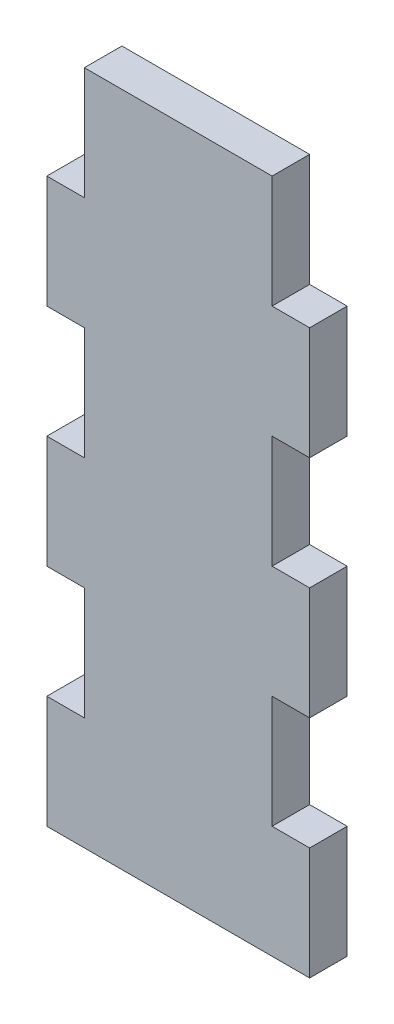
ISO-10303-21;
HEADER;
FILE_DESCRIPTION(('STEP AP214'),'2;1');
FILE_NAME('part.step','',(''),(''),'','','');
FILE_SCHEMA(('AUTOMOTIVE_DESIGN { 1 0 10303 214 1 1 1 1 }'));
ENDSEC;
DATA;
#1=APPLICATION_CONTEXT('core data for automotive mechanical design processes');
#2=APPLICATION_PROTOCOL_DEFINITION('international standard','automotive_design',2000,#1);
#3=PRODUCT_CONTEXT('',#1,'mechanical');
#4=PRODUCT('Part','Part','',(#3));
#5=PRODUCT_RELATED_PRODUCT_CATEGORY('part','',(#4));
#6=PRODUCT_DEFINITION_FORMATION('','',#4);
#7=PRODUCT_DEFINITION_CONTEXT('part definition',#1,'design');
#8=PRODUCT_DEFINITION('design','',#6,#7);
#9=PRODUCT_DEFINITION_SHAPE('','',#8);
#10=(LENGTH_UNIT() NAMED_UNIT(*) SI_UNIT(.MILLI.,.METRE.));
#11=(NAMED_UNIT(*) PLANE_ANGLE_UNIT() SI_UNIT($,.RADIAN.));
#12=(NAMED_UNIT(*) SI_UNIT($,.STERADIAN.) SOLID_ANGLE_UNIT());
#13=UNCERTAINTY_MEASURE_WITH_UNIT(LENGTH_MEASURE(1.E-05),#10,'distance_accuracy_value','');
#14=(GEOMETRIC_REPRESENTATION_CONTEXT(3) GLOBAL_UNCERTAINTY_ASSIGNED_CONTEXT((#13)) GLOBAL_UNIT_ASSIGNED_CONTEXT((#10,
#11,#12)) REPRESENTATION_CONTEXT('',''));
#15=CARTESIAN_POINT('',(0.,0.,0.));
#16=DIRECTION('',(0.,0.,1.));
#17=DIRECTION('',(1.,0.,0.));
#18=AXIS2_PLACEMENT_3D('',#15,#16,#17);
#19=CARTESIAN_POINT('',(25.4993877659802,63.7490223142231,6.));
#20=DIRECTION('',(0.,-1.,0.));
#21=DIRECTION('',(0.,0.,-1.));
#22=AXIS2_PLACEMENT_3D('',#19,#20,#21);
#23=PLANE('',#22);
#24=DIRECTION('',(-1.,0.,0.));
#25=VECTOR('',#24,1.);
#26=CARTESIAN_POINT('',(25.4993877659802,63.7490223142231,0.));
#27=LINE('',#26,#25);
#28=CARTESIAN_POINT('',(25.4993877659802,63.7490223142231,0.));
#29=VERTEX_POINT('',#28);
#30=CARTESIAN_POINT('',(19.4993877659802,63.7490223142231,0.));
#31=VERTEX_POINT('',#30);
#32=EDGE_CURVE('E235',#29,#31,#27,.T.);
#33=ORIENTED_EDGE('',*,*,#32,.T.);
#34=DIRECTION('',(0.,0.,-1.));
#35=VECTOR('',#34,1.);
#36=CARTESIAN_POINT('',(19.4993877659802,63.7490223142231,6.));
#37=LINE('',#36,#35);
#38=CARTESIAN_POINT('',(19.4993877659802,63.7490223142231,6.));
#39=VERTEX_POINT('',#38);
#40=EDGE_CURVE('E11',#39,#31,#37,.T.);
#41=ORIENTED_EDGE('',*,*,#40,.F.);
#42=DIRECTION('',(-1.,0.,0.));
#43=VECTOR('',#42,1.);
#44=CARTESIAN_POINT('',(25.4993877659802,63.7490223142231,6.));
#45=LINE('',#44,#43);
#46=CARTESIAN_POINT('',(25.4993877659802,63.7490223142231,6.));
#47=VERTEX_POINT('',#46);
#48=EDGE_CURVE('E319',#47,#39,#45,.T.);
#49=ORIENTED_EDGE('',*,*,#48,.F.);
#50=DIRECTION('',(0.,0.,-1.));
#51=VECTOR('',#50,1.);
#52=CARTESIAN_POINT('',(25.4993877659802,63.7490223142231,6.));
#53=LINE('',#52,#51);
#54=EDGE_CURVE('E231',#47,#29,#53,.T.);
#55=ORIENTED_EDGE('',*,*,#54,.T.);
#56=EDGE_LOOP('',(#33,#41,#49,#55));
#57=FACE_BOUND('',#56,.T.);
#58=ADVANCED_FACE('F39',(#57),#23,.F.);
#59=CARTESIAN_POINT('',(19.4993877659802,63.7490223142231,6.));
#60=DIRECTION('',(1.,0.,0.));
#61=DIRECTION('',(0.,0.,-1.));
#62=AXIS2_PLACEMENT_3D('',#59,#60,#61);
#63=PLANE('',#62);
#64=DIRECTION('',(0.,-1.,0.));
#65=VECTOR('',#64,1.);
#66=CARTESIAN_POINT('',(19.4993877659802,63.7490223142231,0.));
#67=LINE('',#66,#65);
#68=CARTESIAN_POINT('',(19.4993877659802,45.7490223142231,0.));
#69=VERTEX_POINT('',#68);
#70=EDGE_CURVE('E239',#31,#69,#67,.T.);
#71=ORIENTED_EDGE('',*,*,#70,.T.);
#72=DIRECTION('',(0.,0.,-1.));
#73=VECTOR('',#72,1.);
#74=CARTESIAN_POINT('',(19.4993877659802,45.7490223142231,6.));
#75=LINE('',#74,#73);
#76=CARTESIAN_POINT('',(19.4993877659802,45.7490223142231,6.));
#77=VERTEX_POINT('',#76);
#78=EDGE_CURVE('E48',#77,#69,#75,.T.);
#79=ORIENTED_EDGE('',*,*,#78,.F.);
#80=DIRECTION('',(0.,-1.,0.));
#81=VECTOR('',#80,1.);
#82=CARTESIAN_POINT('',(19.4993877659802,63.7490223142231,6.));
#83=LINE('',#82,#81);
#84=EDGE_CURVE('E143',#39,#77,#83,.T.);
#85=ORIENTED_EDGE('',*,*,#84,.F.);
#86=ORIENTED_EDGE('',*,*,#40,.T.);
#87=EDGE_LOOP('',(#71,#79,#85,#86));
#88=FACE_BOUND('',#87,.T.);
#89=ADVANCED_FACE('F495',(#88),#63,.F.);
#90=CARTESIAN_POINT('',(19.4993877659802,45.7490223142231,6.));
#91=DIRECTION('',(0.,1.,0.));
#92=DIRECTION('',(0.,0.,1.));
#93=AXIS2_PLACEMENT_3D('',#90,#91,#92);
#94=PLANE('',#93);
#95=DIRECTION('',(1.,0.,0.));
#96=VECTOR('',#95,1.);
#97=CARTESIAN_POINT('',(19.4993877659802,45.7490223142231,0.));
#98=LINE('',#97,#96);
#99=CARTESIAN_POINT('',(25.4993877659802,45.7490223142231,0.));
#100=VERTEX_POINT('',#99);
#101=EDGE_CURVE('E242',#69,#100,#98,.T.);
#102=ORIENTED_EDGE('',*,*,#101,.T.);
#103=DIRECTION('',(0.,0.,-1.));
#104=VECTOR('',#103,1.);
#105=CARTESIAN_POINT('',(25.4993877659802,45.7490223142231,6.));
#106=LINE('',#105,#104);
#107=CARTESIAN_POINT('',(25.4993877659802,45.7490223142231,6.));
#108=VERTEX_POINT('',#107);
#109=EDGE_CURVE('E381',#108,#100,#106,.T.);
#110=ORIENTED_EDGE('',*,*,#109,.F.);
#111=DIRECTION('',(1.,0.,0.));
#112=VECTOR('',#111,1.);
#113=CARTESIAN_POINT('',(19.4993877659802,45.7490223142231,6.));
#114=LINE('',#113,#112);
#115=EDGE_CURVE('E391',#77,#108,#114,.T.);
#116=ORIENTED_EDGE('',*,*,#115,.F.);
#117=ORIENTED_EDGE('',*,*,#78,.T.);
#118=EDGE_LOOP('',(#102,#110,#116,#117));
#119=FACE_BOUND('',#118,.T.);
#120=ADVANCED_FACE('F389',(#119),#94,.F.);
#121=CARTESIAN_POINT('',(25.4993877659802,45.7490223142231,6.));
#122=DIRECTION('',(1.,0.,0.));
#123=DIRECTION('',(0.,0.,-1.));
#124=AXIS2_PLACEMENT_3D('',#121,#122,#123);
#125=PLANE('',#124);
#126=DIRECTION('',(0.,-1.,0.));
#127=VECTOR('',#126,1.);
#128=CARTESIAN_POINT('',(25.4993877659802,45.7490223142231,0.));
#129=LINE('',#128,#127);
#130=CARTESIAN_POINT('',(25.4993877659802,27.7490223142231,0.));
#131=VERTEX_POINT('',#130);
#132=EDGE_CURVE('E245',#100,#131,#129,.T.);
#133=ORIENTED_EDGE('',*,*,#132,.T.);
#134=DIRECTION('',(0.,0.,-1.));
#135=VECTOR('',#134,1.);
#136=CARTESIAN_POINT('',(25.4993877659802,27.7490223142231,6.));
#137=LINE('',#136,#135);
#138=CARTESIAN_POINT('',(25.4993877659802,27.7490223142231,6.));
#139=VERTEX_POINT('',#138);
#140=EDGE_CURVE('E377',#139,#131,#137,.T.);
#141=ORIENTED_EDGE('',*,*,#140,.F.);
#142=DIRECTION('',(0.,-1.,0.));
#143=VECTOR('',#142,1.);
#144=CARTESIAN_POINT('',(25.4993877659802,45.7490223142231,6.));
#145=LINE('',#144,#143);
#146=EDGE_CURVE('E410',#108,#139,#145,.T.);
#147=ORIENTED_EDGE('',*,*,#146,.F.);
#148=ORIENTED_EDGE('',*,*,#109,.T.);
#149=EDGE_LOOP('',(#133,#141,#147,#148));
#150=FACE_BOUND('',#149,.T.);
#151=ADVANCED_FACE('F400',(#150),#125,.F.);
#152=CARTESIAN_POINT('',(25.4993877659802,27.7490223142231,6.));
#153=DIRECTION('',(0.,-1.,0.));
#154=DIRECTION('',(0.,0.,-1.));
#155=AXIS2_PLACEMENT_3D('',#152,#153,#154);
#156=PLANE('',#155);
#157=DIRECTION('',(-1.,0.,0.));
#158=VECTOR('',#157,1.);
#159=CARTESIAN_POINT('',(25.4993877659802,27.7490223142231,0.));
#160=LINE('',#159,#158);
#161=CARTESIAN_POINT('',(19.4993877659802,27.7490223142231,0.));
#162=VERTEX_POINT('',#161);
#163=EDGE_CURVE('E248',#131,#162,#160,.T.);
#164=ORIENTED_EDGE('',*,*,#163,.T.);
#165=DIRECTION('',(0.,0.,-1.));
#166=VECTOR('',#165,1.);
#167=CARTESIAN_POINT('',(19.4993877659802,27.7490223142231,6.));
#168=LINE('',#167,#166);
#169=CARTESIAN_POINT('',(19.4993877659802,27.7490223142231,6.));
#170=VERTEX_POINT('',#169);
#171=EDGE_CURVE('E373',#170,#162,#168,.T.);
#172=ORIENTED_EDGE('',*,*,#171,.F.);
#173=DIRECTION('',(-1.,0.,0.));
#174=VECTOR('',#173,1.);
#175=CARTESIAN_POINT('',(25.4993877659802,27.7490223142231,6.));
#176=LINE('',#175,#174);
#177=EDGE_CURVE('E406',#139,#170,#176,.T.);
#178=ORIENTED_EDGE('',*,*,#177,.F.);
#179=ORIENTED_EDGE('',*,*,#140,.T.);
#180=EDGE_LOOP('',(#164,#172,#178,#179));
#181=FACE_BOUND('',#180,.T.);
#182=ADVANCED_FACE('F404',(#181),#156,.F.);
#183=CARTESIAN_POINT('',(19.4993877659802,27.7490223142231,6.));
#184=DIRECTION('',(1.,0.,0.));
#185=DIRECTION('',(0.,0.,-1.));
#186=AXIS2_PLACEMENT_3D('',#183,#184,#185);
#187=PLANE('',#186);
#188=DIRECTION('',(0.,-1.,0.));
#189=VECTOR('',#188,1.);
#190=CARTESIAN_POINT('',(19.4993877659802,27.7490223142231,0.));
#191=LINE('',#190,#189);
#192=CARTESIAN_POINT('',(19.4993877659802,9.74902231422313,0.));
#193=VERTEX_POINT('',#192);
#194=EDGE_CURVE('E251',#162,#193,#191,.T.);
#195=ORIENTED_EDGE('',*,*,#194,.T.);
#196=DIRECTION('',(0.,0.,-1.));
#197=VECTOR('',#196,1.);
#198=CARTESIAN_POINT('',(19.4993877659802,9.74902231422313,6.));
#199=LINE('',#198,#197);
#200=CARTESIAN_POINT('',(19.4993877659802,9.74902231422313,6.));
#201=VERTEX_POINT('',#200);
#202=EDGE_CURVE('E369',#201,#193,#199,.T.);
#203=ORIENTED_EDGE('',*,*,#202,.F.);
#204=DIRECTION('',(0.,-1.,0.));
#205=VECTOR('',#204,1.);
#206=CARTESIAN_POINT('',(19.4993877659802,27.7490223142231,6.));
#207=LINE('',#206,#205);
#208=EDGE_CURVE('E409',#170,#201,#207,.T.);
#209=ORIENTED_EDGE('',*,*,#208,.F.);
#210=ORIENTED_EDGE('',*,*,#171,.T.);
#211=EDGE_LOOP('',(#195,#203,#209,#210));
#212=FACE_BOUND('',#211,.T.);
#213=ADVANCED_FACE('F508',(#212),#187,.F.);
#214=CARTESIAN_POINT('',(19.4993877659802,9.74902231422313,6.));
#215=DIRECTION('',(0.,1.,0.));
#216=DIRECTION('',(0.,0.,1.));
#217=AXIS2_PLACEMENT_3D('',#214,#215,#216);
#218=PLANE('',#217);
#219=DIRECTION('',(1.,0.,0.));
#220=VECTOR('',#219,1.);
#221=CARTESIAN_POINT('',(19.4993877659802,9.74902231422313,0.));
#222=LINE('',#221,#220);
#223=CARTESIAN_POINT('',(61.4993877659802,9.74902231422313,0.));
#224=VERTEX_POINT('',#223);
#225=EDGE_CURVE('E254',#193,#224,#222,.T.);
#226=ORIENTED_EDGE('',*,*,#225,.T.);
#227=DIRECTION('',(0.,0.,-1.));
#228=VECTOR('',#227,1.);
#229=CARTESIAN_POINT('',(61.4993877659802,9.74902231422313,6.));
#230=LINE('',#229,#228);
#231=CARTESIAN_POINT('',(61.4993877659802,9.74902231422313,6.));
#232=VERTEX_POINT('',#231);
#233=EDGE_CURVE('E366',#232,#224,#230,.T.);
#234=ORIENTED_EDGE('',*,*,#233,.F.);
#235=DIRECTION('',(1.,0.,0.));
#236=VECTOR('',#235,1.);
#237=CARTESIAN_POINT('',(19.4993877659802,9.74902231422313,6.));
#238=LINE('',#237,#236);
#239=EDGE_CURVE('E414',#201,#232,#238,.T.);
#240=ORIENTED_EDGE('',*,*,#239,.F.);
#241=ORIENTED_EDGE('',*,*,#202,.T.);
#242=EDGE_LOOP('',(#226,#234,#240,#241));
#243=FACE_BOUND('',#242,.T.);
#244=ADVANCED_FACE('F511',(#243),#218,.F.);
#245=CARTESIAN_POINT('',(61.4993877659802,27.7490223142231,6.));
#246=DIRECTION('',(1.,0.,0.));
#247=DIRECTION('',(0.,0.,-1.));
#248=AXIS2_PLACEMENT_3D('',#245,#246,#247);
#249=PLANE('',#248);
#250=DIRECTION('',(0.,-1.,0.));
#251=VECTOR('',#250,1.);
#252=CARTESIAN_POINT('',(61.4993877659802,27.7490223142231,0.));
#253=LINE('',#252,#251);
#254=CARTESIAN_POINT('',(61.4993877659802,27.7490223142231,0.));
#255=VERTEX_POINT('',#254);
#256=EDGE_CURVE('E258',#255,#224,#253,.T.);
#257=ORIENTED_EDGE('',*,*,#256,.F.);
#258=DIRECTION('',(0.,0.,-1.));
#259=VECTOR('',#258,1.);
#260=CARTESIAN_POINT('',(61.4993877659802,27.7490223142231,6.));
#261=LINE('',#260,#259);
#262=CARTESIAN_POINT('',(61.4993877659802,27.7490223142231,6.));
#263=VERTEX_POINT('',#262);
#264=EDGE_CURVE('E363',#263,#255,#261,.T.);
#265=ORIENTED_EDGE('',*,*,#264,.F.);
#266=DIRECTION('',(0.,-1.,0.));
#267=VECTOR('',#266,1.);
#268=CARTESIAN_POINT('',(61.4993877659802,27.7490223142231,6.));
#269=LINE('',#268,#267);
#270=EDGE_CURVE('E421',#263,#232,#269,.T.);
#271=ORIENTED_EDGE('',*,*,#270,.T.);
#272=ORIENTED_EDGE('',*,*,#233,.T.);
#273=EDGE_LOOP('',(#257,#265,#271,#272));
#274=FACE_BOUND('',#273,.T.);
#275=ADVANCED_FACE('F515',(#274),#249,.T.);
#276=CARTESIAN_POINT('',(55.4993877659802,27.7490223142231,6.));
#277=DIRECTION('',(0.,1.,0.));
#278=DIRECTION('',(0.,0.,1.));
#279=AXIS2_PLACEMENT_3D('',#276,#277,#278);
#280=PLANE('',#279);
#281=DIRECTION('',(1.,0.,0.));
#282=VECTOR('',#281,1.);
#283=CARTESIAN_POINT('',(55.4993877659802,27.7490223142231,0.));
#284=LINE('',#283,#282);
#285=CARTESIAN_POINT('',(55.4993877659802,27.7490223142231,0.));
#286=VERTEX_POINT('',#285);
#287=EDGE_CURVE('E262',#286,#255,#284,.T.);
#288=ORIENTED_EDGE('',*,*,#287,.F.);
#289=DIRECTION('',(0.,0.,-1.));
#290=VECTOR('',#289,1.);
#291=CARTESIAN_POINT('',(55.4993877659802,27.7490223142231,6.));
#292=LINE('',#291,#290);
#293=CARTESIAN_POINT('',(55.4993877659802,27.7490223142231,6.));
#294=VERTEX_POINT('',#293);
#295=EDGE_CURVE('E360',#294,#286,#292,.T.);
#296=ORIENTED_EDGE('',*,*,#295,.F.);
#297=DIRECTION('',(1.,0.,0.));
#298=VECTOR('',#297,1.);
#299=CARTESIAN_POINT('',(55.4993877659802,27.7490223142231,6.));
#300=LINE('',#299,#298);
#301=EDGE_CURVE('E425',#294,#263,#300,.T.);
#302=ORIENTED_EDGE('',*,*,#301,.T.);
#303=ORIENTED_EDGE('',*,*,#264,.T.);
#304=EDGE_LOOP('',(#288,#296,#302,#303));
#305=FACE_BOUND('',#304,.T.);
#306=ADVANCED_FACE('F519',(#305),#280,.T.);
#307=CARTESIAN_POINT('',(55.4993877659802,45.7490223142231,6.));
#308=DIRECTION('',(1.,0.,0.));
#309=DIRECTION('',(0.,0.,-1.));
#310=AXIS2_PLACEMENT_3D('',#307,#308,#309);
#311=PLANE('',#310);
#312=DIRECTION('',(0.,-1.,0.));
#313=VECTOR('',#312,1.);
#314=CARTESIAN_POINT('',(55.4993877659802,45.7490223142231,0.));
#315=LINE('',#314,#313);
#316=CARTESIAN_POINT('',(55.4993877659802,45.7490223142231,0.));
#317=VERTEX_POINT('',#316);
#318=EDGE_CURVE('E266',#317,#286,#315,.T.);
#319=ORIENTED_EDGE('',*,*,#318,.F.);
#320=DIRECTION('',(0.,0.,-1.));
#321=VECTOR('',#320,1.);
#322=CARTESIAN_POINT('',(55.4993877659802,45.7490223142231,6.));
#323=LINE('',#322,#321);
#324=CARTESIAN_POINT('',(55.4993877659802,45.7490223142231,6.));
#325=VERTEX_POINT('',#324);
#326=EDGE_CURVE('E357',#325,#317,#323,.T.);
#327=ORIENTED_EDGE('',*,*,#326,.F.);
#328=DIRECTION('',(0.,-1.,0.));
#329=VECTOR('',#328,1.);
#330=CARTESIAN_POINT('',(55.4993877659802,45.7490223142231,6.));
#331=LINE('',#330,#329);
#332=EDGE_CURVE('E429',#325,#294,#331,.T.);
#333=ORIENTED_EDGE('',*,*,#332,.T.);
#334=ORIENTED_EDGE('',*,*,#295,.T.);
#335=EDGE_LOOP('',(#319,#327,#333,#334));
#336=FACE_BOUND('',#335,.T.);
#337=ADVANCED_FACE('F523',(#336),#311,.T.);
#338=CARTESIAN_POINT('',(61.4993877659802,45.7490223142231,6.));
#339=DIRECTION('',(0.,-1.,0.));
#340=DIRECTION('',(0.,0.,-1.));
#341=AXIS2_PLACEMENT_3D('',#338,#339,#340);
#342=PLANE('',#341);
#343=DIRECTION('',(-1.,0.,0.));
#344=VECTOR('',#343,1.);
#345=CARTESIAN_POINT('',(61.4993877659802,45.7490223142231,0.));
#346=LINE('',#345,#344);
#347=CARTESIAN_POINT('',(61.4993877659802,45.7490223142231,0.));
#348=VERTEX_POINT('',#347);
#349=EDGE_CURVE('E270',#348,#317,#346,.T.);
#350=ORIENTED_EDGE('',*,*,#349,.F.);
#351=DIRECTION('',(0.,0.,-1.));
#352=VECTOR('',#351,1.);
#353=CARTESIAN_POINT('',(61.4993877659802,45.7490223142231,6.));
#354=LINE('',#353,#352);
#355=CARTESIAN_POINT('',(61.4993877659802,45.7490223142231,6.));
#356=VERTEX_POINT('',#355);
#357=EDGE_CURVE('E354',#356,#348,#354,.T.);
#358=ORIENTED_EDGE('',*,*,#357,.F.);
#359=DIRECTION('',(-1.,0.,0.));
#360=VECTOR('',#359,1.);
#361=CARTESIAN_POINT('',(61.4993877659802,45.7490223142231,6.));
#362=LINE('',#361,#360);
#363=EDGE_CURVE('E433',#356,#325,#362,.T.);
#364=ORIENTED_EDGE('',*,*,#363,.T.);
#365=ORIENTED_EDGE('',*,*,#326,.T.);
#366=EDGE_LOOP('',(#350,#358,#364,#365));
#367=FACE_BOUND('',#366,.T.);
#368=ADVANCED_FACE('F527',(#367),#342,.T.);
#369=CARTESIAN_POINT('',(61.4993877659802,63.7490223142231,6.));
#370=DIRECTION('',(1.,0.,0.));
#371=DIRECTION('',(0.,0.,-1.));
#372=AXIS2_PLACEMENT_3D('',#369,#370,#371);
#373=PLANE('',#372);
#374=DIRECTION('',(0.,-1.,0.));
#375=VECTOR('',#374,1.);
#376=CARTESIAN_POINT('',(61.4993877659802,63.7490223142231,0.));
#377=LINE('',#376,#375);
#378=CARTESIAN_POINT('',(61.4993877659802,63.7490223142231,0.));
#379=VERTEX_POINT('',#378);
#380=EDGE_CURVE('E274',#379,#348,#377,.T.);
#381=ORIENTED_EDGE('',*,*,#380,.F.);
#382=DIRECTION('',(0.,0.,-1.));
#383=VECTOR('',#382,1.);
#384=CARTESIAN_POINT('',(61.4993877659802,63.7490223142231,6.));
#385=LINE('',#384,#383);
#386=CARTESIAN_POINT('',(61.4993877659802,63.7490223142231,6.));
#387=VERTEX_POINT('',#386);
#388=EDGE_CURVE('E351',#387,#379,#385,.T.);
#389=ORIENTED_EDGE('',*,*,#388,.F.);
#390=DIRECTION('',(0.,-1.,0.));
#391=VECTOR('',#390,1.);
#392=CARTESIAN_POINT('',(61.4993877659802,63.7490223142231,6.));
#393=LINE('',#392,#391);
#394=EDGE_CURVE('E437',#387,#356,#393,.T.);
#395=ORIENTED_EDGE('',*,*,#394,.T.);
#396=ORIENTED_EDGE('',*,*,#357,.T.);
#397=EDGE_LOOP('',(#381,#389,#395,#396));
#398=FACE_BOUND('',#397,.T.);
#399=ADVANCED_FACE('F531',(#398),#373,.T.);
#400=CARTESIAN_POINT('',(55.4993877659802,63.7490223142231,6.));
#401=DIRECTION('',(0.,1.,0.));
#402=DIRECTION('',(0.,0.,1.));
#403=AXIS2_PLACEMENT_3D('',#400,#401,#402);
#404=PLANE('',#403);
#405=DIRECTION('',(1.,0.,0.));
#406=VECTOR('',#405,1.);
#407=CARTESIAN_POINT('',(55.4993877659802,63.7490223142231,0.));
#408=LINE('',#407,#406);
#409=CARTESIAN_POINT('',(55.4993877659802,63.7490223142231,0.));
#410=VERTEX_POINT('',#409);
#411=EDGE_CURVE('E278',#410,#379,#408,.T.);
#412=ORIENTED_EDGE('',*,*,#411,.F.);
#413=DIRECTION('',(0.,0.,-1.));
#414=VECTOR('',#413,1.);
#415=CARTESIAN_POINT('',(55.4993877659802,63.7490223142231,6.));
#416=LINE('',#415,#414);
#417=CARTESIAN_POINT('',(55.4993877659802,63.7490223142231,6.));
#418=VERTEX_POINT('',#417);
#419=EDGE_CURVE('E348',#418,#410,#416,.T.);
#420=ORIENTED_EDGE('',*,*,#419,.F.);
#421=DIRECTION('',(1.,0.,0.));
#422=VECTOR('',#421,1.);
#423=CARTESIAN_POINT('',(55.4993877659802,63.7490223142231,6.));
#424=LINE('',#423,#422);
#425=EDGE_CURVE('E441',#418,#387,#424,.T.);
#426=ORIENTED_EDGE('',*,*,#425,.T.);
#427=ORIENTED_EDGE('',*,*,#388,.T.);
#428=EDGE_LOOP('',(#412,#420,#426,#427));
#429=FACE_BOUND('',#428,.T.);
#430=ADVANCED_FACE('F535',(#429),#404,.T.);
#431=CARTESIAN_POINT('',(55.4993877659802,81.7490223142231,6.));
#432=DIRECTION('',(1.,0.,0.));
#433=DIRECTION('',(0.,0.,-1.));
#434=AXIS2_PLACEMENT_3D('',#431,#432,#433);
#435=PLANE('',#434);
#436=DIRECTION('',(0.,-1.,0.));
#437=VECTOR('',#436,1.);
#438=CARTESIAN_POINT('',(55.4993877659802,81.7490223142231,0.));
#439=LINE('',#438,#437);
#440=CARTESIAN_POINT('',(55.4993877659802,81.7490223142231,0.));
#441=VERTEX_POINT('',#440);
#442=EDGE_CURVE('E282',#441,#410,#439,.T.);
#443=ORIENTED_EDGE('',*,*,#442,.F.);
#444=DIRECTION('',(0.,0.,-1.));
#445=VECTOR('',#444,1.);
#446=CARTESIAN_POINT('',(55.4993877659802,81.7490223142231,6.));
#447=LINE('',#446,#445);
#448=CARTESIAN_POINT('',(55.4993877659802,81.7490223142231,6.));
#449=VERTEX_POINT('',#448);
#450=EDGE_CURVE('E345',#449,#441,#447,.T.);
#451=ORIENTED_EDGE('',*,*,#450,.F.);
#452=DIRECTION('',(0.,-1.,0.));
#453=VECTOR('',#452,1.);
#454=CARTESIAN_POINT('',(55.4993877659802,81.7490223142231,6.));
#455=LINE('',#454,#453);
#456=EDGE_CURVE('E445',#449,#418,#455,.T.);
#457=ORIENTED_EDGE('',*,*,#456,.T.);
#458=ORIENTED_EDGE('',*,*,#419,.T.);
#459=EDGE_LOOP('',(#443,#451,#457,#458));
#460=FACE_BOUND('',#459,.T.);
#461=ADVANCED_FACE('F539',(#460),#435,.T.);
#462=CARTESIAN_POINT('',(55.4993877659802,81.7490223142231,6.));
#463=DIRECTION('',(0.,1.,0.));
#464=DIRECTION('',(0.,0.,1.));
#465=AXIS2_PLACEMENT_3D('',#462,#463,#464);
#466=PLANE('',#465);
#467=DIRECTION('',(1.,0.,0.));
#468=VECTOR('',#467,1.);
#469=CARTESIAN_POINT('',(55.4993877659802,81.7490223142231,0.));
#470=LINE('',#469,#468);
#471=CARTESIAN_POINT('',(61.4993877659802,81.7490223142231,0.));
#472=VERTEX_POINT('',#471);
#473=EDGE_CURVE('E286',#441,#472,#470,.T.);
#474=ORIENTED_EDGE('',*,*,#473,.T.);
#475=DIRECTION('',(0.,0.,-1.));
#476=VECTOR('',#475,1.);
#477=CARTESIAN_POINT('',(61.4993877659802,81.7490223142231,6.));
#478=LINE('',#477,#476);
#479=CARTESIAN_POINT('',(61.4993877659802,81.7490223142231,6.));
#480=VERTEX_POINT('',#479);
#481=EDGE_CURVE('E342',#480,#472,#478,.T.);
#482=ORIENTED_EDGE('',*,*,#481,.F.);
#483=DIRECTION('',(1.,0.,0.));
#484=VECTOR('',#483,1.);
#485=CARTESIAN_POINT('',(55.4993877659802,81.7490223142231,6.));
#486=LINE('',#485,#484);
#487=EDGE_CURVE('E449',#449,#480,#486,.T.);
#488=ORIENTED_EDGE('',*,*,#487,.F.);
#489=ORIENTED_EDGE('',*,*,#450,.T.);
#490=EDGE_LOOP('',(#474,#482,#488,#489));
#491=FACE_BOUND('',#490,.T.);
#492=ADVANCED_FACE('F543',(#491),#466,.F.);
#493=CARTESIAN_POINT('',(61.4993877659802,99.7490223142231,6.));
#494=DIRECTION('',(1.,0.,0.));
#495=DIRECTION('',(0.,0.,-1.));
#496=AXIS2_PLACEMENT_3D('',#493,#494,#495);
#497=PLANE('',#496);
#498=DIRECTION('',(0.,-1.,0.));
#499=VECTOR('',#498,1.);
#500=CARTESIAN_POINT('',(61.4993877659802,99.7490223142231,0.));
#501=LINE('',#500,#499);
#502=CARTESIAN_POINT('',(61.4993877659802,99.7490223142231,0.));
#503=VERTEX_POINT('',#502);
#504=EDGE_CURVE('E290',#503,#472,#501,.T.);
#505=ORIENTED_EDGE('',*,*,#504,.F.);
#506=DIRECTION('',(0.,0.,-1.));
#507=VECTOR('',#506,1.);
#508=CARTESIAN_POINT('',(61.4993877659802,99.7490223142231,6.));
#509=LINE('',#508,#507);
#510=CARTESIAN_POINT('',(61.4993877659802,99.7490223142231,6.));
#511=VERTEX_POINT('',#510);
#512=EDGE_CURVE('E339',#511,#503,#509,.T.);
#513=ORIENTED_EDGE('',*,*,#512,.F.);
#514=DIRECTION('',(0.,-1.,0.));
#515=VECTOR('',#514,1.);
#516=CARTESIAN_POINT('',(61.4993877659802,99.7490223142231,6.));
#517=LINE('',#516,#515);
#518=EDGE_CURVE('E452',#511,#480,#517,.T.);
#519=ORIENTED_EDGE('',*,*,#518,.T.);
#520=ORIENTED_EDGE('',*,*,#481,.T.);
#521=EDGE_LOOP('',(#505,#513,#519,#520));
#522=FACE_BOUND('',#521,.T.);
#523=ADVANCED_FACE('F547',(#522),#497,.T.);
#524=CARTESIAN_POINT('',(55.4993877659802,99.7490223142231,6.));
#525=DIRECTION('',(0.,1.,0.));
#526=DIRECTION('',(0.,0.,1.));
#527=AXIS2_PLACEMENT_3D('',#524,#525,#526);
#528=PLANE('',#527);
#529=DIRECTION('',(1.,0.,0.));
#530=VECTOR('',#529,1.);
#531=CARTESIAN_POINT('',(55.4993877659802,99.7490223142231,0.));
#532=LINE('',#531,#530);
#533=CARTESIAN_POINT('',(55.4993877659802,99.7490223142231,0.));
#534=VERTEX_POINT('',#533);
#535=EDGE_CURVE('E294',#534,#503,#532,.T.);
#536=ORIENTED_EDGE('',*,*,#535,.F.);
#537=DIRECTION('',(0.,0.,-1.));
#538=VECTOR('',#537,1.);
#539=CARTESIAN_POINT('',(55.4993877659802,99.7490223142231,6.));
#540=LINE('',#539,#538);
#541=CARTESIAN_POINT('',(55.4993877659802,99.7490223142231,6.));
#542=VERTEX_POINT('',#541);
#543=EDGE_CURVE('E336',#542,#534,#540,.T.);
#544=ORIENTED_EDGE('',*,*,#543,.F.);
#545=DIRECTION('',(1.,0.,0.));
#546=VECTOR('',#545,1.);
#547=CARTESIAN_POINT('',(55.4993877659802,99.7490223142231,6.));
#548=LINE('',#547,#546);
#549=EDGE_CURVE('E456',#542,#511,#548,.T.);
#550=ORIENTED_EDGE('',*,*,#549,.T.);
#551=ORIENTED_EDGE('',*,*,#512,.T.);
#552=EDGE_LOOP('',(#536,#544,#550,#551));
#553=FACE_BOUND('',#552,.T.);
#554=ADVANCED_FACE('F551',(#553),#528,.T.);
#555=CARTESIAN_POINT('',(55.4993877659802,117.749022314223,6.));
#556=DIRECTION('',(1.,0.,0.));
#557=DIRECTION('',(0.,0.,-1.));
#558=AXIS2_PLACEMENT_3D('',#555,#556,#557);
#559=PLANE('',#558);
#560=DIRECTION('',(0.,-1.,0.));
#561=VECTOR('',#560,1.);
#562=CARTESIAN_POINT('',(55.4993877659802,117.749022314223,0.));
#563=LINE('',#562,#561);
#564=CARTESIAN_POINT('',(55.4993877659802,117.749022314223,0.));
#565=VERTEX_POINT('',#564);
#566=EDGE_CURVE('E298',#565,#534,#563,.T.);
#567=ORIENTED_EDGE('',*,*,#566,.F.);
#568=DIRECTION('',(0.,0.,-1.));
#569=VECTOR('',#568,1.);
#570=CARTESIAN_POINT('',(55.4993877659802,117.749022314223,6.));
#571=LINE('',#570,#569);
#572=CARTESIAN_POINT('',(55.4993877659802,117.749022314223,6.));
#573=VERTEX_POINT('',#572);
#574=EDGE_CURVE('E333',#573,#565,#571,.T.);
#575=ORIENTED_EDGE('',*,*,#574,.F.);
#576=DIRECTION('',(0.,-1.,0.));
#577=VECTOR('',#576,1.);
#578=CARTESIAN_POINT('',(55.4993877659802,117.749022314223,6.));
#579=LINE('',#578,#577);
#580=EDGE_CURVE('E460',#573,#542,#579,.T.);
#581=ORIENTED_EDGE('',*,*,#580,.T.);
#582=ORIENTED_EDGE('',*,*,#543,.T.);
#583=EDGE_LOOP('',(#567,#575,#581,#582));
#584=FACE_BOUND('',#583,.T.);
#585=ADVANCED_FACE('F555',(#584),#559,.T.);
#586=CARTESIAN_POINT('',(25.4993877659802,117.749022314223,6.));
#587=DIRECTION('',(0.,1.,0.));
#588=DIRECTION('',(0.,0.,1.));
#589=AXIS2_PLACEMENT_3D('',#586,#587,#588);
#590=PLANE('',#589);
#591=DIRECTION('',(1.,0.,0.));
#592=VECTOR('',#591,1.);
#593=CARTESIAN_POINT('',(25.4993877659802,117.749022314223,0.));
#594=LINE('',#593,#592);
#595=CARTESIAN_POINT('',(25.4993877659802,117.749022314223,0.));
#596=VERTEX_POINT('',#595);
#597=EDGE_CURVE('E302',#596,#565,#594,.T.);
#598=ORIENTED_EDGE('',*,*,#597,.F.);
#599=DIRECTION('',(0.,0.,-1.));
#600=VECTOR('',#599,1.);
#601=CARTESIAN_POINT('',(25.4993877659802,117.749022314223,6.));
#602=LINE('',#601,#600);
#603=CARTESIAN_POINT('',(25.4993877659802,117.749022314223,6.));
#604=VERTEX_POINT('',#603);
#605=EDGE_CURVE('E330',#604,#596,#602,.T.);
#606=ORIENTED_EDGE('',*,*,#605,.F.);
#607=DIRECTION('',(1.,0.,0.));
#608=VECTOR('',#607,1.);
#609=CARTESIAN_POINT('',(25.4993877659802,117.749022314223,6.));
#610=LINE('',#609,#608);
#611=EDGE_CURVE('E464',#604,#573,#610,.T.);
#612=ORIENTED_EDGE('',*,*,#611,.T.);
#613=ORIENTED_EDGE('',*,*,#574,.T.);
#614=EDGE_LOOP('',(#598,#606,#612,#613));
#615=FACE_BOUND('',#614,.T.);
#616=ADVANCED_FACE('F559',(#615),#590,.T.);
#617=CARTESIAN_POINT('',(25.4993877659802,117.749022314223,6.));
#618=DIRECTION('',(1.,0.,0.));
#619=DIRECTION('',(0.,0.,-1.));
#620=AXIS2_PLACEMENT_3D('',#617,#618,#619);
#621=PLANE('',#620);
#622=DIRECTION('',(0.,-1.,0.));
#623=VECTOR('',#622,1.);
#624=CARTESIAN_POINT('',(25.4993877659802,117.749022314223,0.));
#625=LINE('',#624,#623);
#626=CARTESIAN_POINT('',(25.4993877659802,99.7490223142231,0.));
#627=VERTEX_POINT('',#626);
#628=EDGE_CURVE('E306',#596,#627,#625,.T.);
#629=ORIENTED_EDGE('',*,*,#628,.T.);
#630=DIRECTION('',(0.,0.,-1.));
#631=VECTOR('',#630,1.);
#632=CARTESIAN_POINT('',(25.4993877659802,99.7490223142231,6.));
#633=LINE('',#632,#631);
#634=CARTESIAN_POINT('',(25.4993877659802,99.7490223142231,6.));
#635=VERTEX_POINT('',#634);
#636=EDGE_CURVE('E326',#635,#627,#633,.T.);
#637=ORIENTED_EDGE('',*,*,#636,.F.);
#638=DIRECTION('',(0.,-1.,0.));
#639=VECTOR('',#638,1.);
#640=CARTESIAN_POINT('',(25.4993877659802,117.749022314223,6.));
#641=LINE('',#640,#639);
#642=EDGE_CURVE('E468',#604,#635,#641,.T.);
#643=ORIENTED_EDGE('',*,*,#642,.F.);
#644=ORIENTED_EDGE('',*,*,#605,.T.);
#645=EDGE_LOOP('',(#629,#637,#643,#644));
#646=FACE_BOUND('',#645,.T.);
#647=ADVANCED_FACE('F476',(#646),#621,.F.);
#648=CARTESIAN_POINT('',(25.4993877659802,99.7490223142231,6.));
#649=DIRECTION('',(0.,-1.,0.));
#650=DIRECTION('',(0.,0.,-1.));
#651=AXIS2_PLACEMENT_3D('',#648,#649,#650);
#652=PLANE('',#651);
#653=DIRECTION('',(-1.,0.,0.));
#654=VECTOR('',#653,1.);
#655=CARTESIAN_POINT('',(25.4993877659802,99.7490223142231,0.));
#656=LINE('',#655,#654);
#657=CARTESIAN_POINT('',(19.4993877659802,99.7490223142231,0.));
#658=VERTEX_POINT('',#657);
#659=EDGE_CURVE('E309',#627,#658,#656,.T.);
#660=ORIENTED_EDGE('',*,*,#659,.T.);
#661=DIRECTION('',(0.,0.,-1.));
#662=VECTOR('',#661,1.);
#663=CARTESIAN_POINT('',(19.4993877659802,99.7490223142231,6.));
#664=LINE('',#663,#662);
#665=CARTESIAN_POINT('',(19.4993877659802,99.7490223142231,6.));
#666=VERTEX_POINT('',#665);
#667=EDGE_CURVE('E225',#666,#658,#664,.T.);
#668=ORIENTED_EDGE('',*,*,#667,.F.);
#669=DIRECTION('',(-1.,0.,0.));
#670=VECTOR('',#669,1.);
#671=CARTESIAN_POINT('',(25.4993877659802,99.7490223142231,6.));
#672=LINE('',#671,#670);
#673=EDGE_CURVE('E210',#635,#666,#672,.T.);
#674=ORIENTED_EDGE('',*,*,#673,.F.);
#675=ORIENTED_EDGE('',*,*,#636,.T.);
#676=EDGE_LOOP('',(#660,#668,#674,#675));
#677=FACE_BOUND('',#676,.T.);
#678=ADVANCED_FACE('F480',(#677),#652,.F.);
#679=CARTESIAN_POINT('',(19.4993877659802,99.7490223142231,6.));
#680=DIRECTION('',(1.,0.,0.));
#681=DIRECTION('',(0.,0.,-1.));
#682=AXIS2_PLACEMENT_3D('',#679,#680,#681);
#683=PLANE('',#682);
#684=DIRECTION('',(0.,-1.,0.));
#685=VECTOR('',#684,1.);
#686=CARTESIAN_POINT('',(19.4993877659802,99.7490223142231,0.));
#687=LINE('',#686,#685);
#688=CARTESIAN_POINT('',(19.4993877659802,81.7490223142231,0.));
#689=VERTEX_POINT('',#688);
#690=EDGE_CURVE('E220',#658,#689,#687,.T.);
#691=ORIENTED_EDGE('',*,*,#690,.T.);
#692=DIRECTION('',(0.,0.,-1.));
#693=VECTOR('',#692,1.);
#694=CARTESIAN_POINT('',(19.4993877659802,81.7490223142231,6.));
#695=LINE('',#694,#693);
#696=CARTESIAN_POINT('',(19.4993877659802,81.7490223142231,6.));
#697=VERTEX_POINT('',#696);
#698=EDGE_CURVE('E217',#697,#689,#695,.T.);
#699=ORIENTED_EDGE('',*,*,#698,.F.);
#700=DIRECTION('',(0.,-1.,0.));
#701=VECTOR('',#700,1.);
#702=CARTESIAN_POINT('',(19.4993877659802,99.7490223142231,6.));
#703=LINE('',#702,#701);
#704=EDGE_CURVE('E204',#666,#697,#703,.T.);
#705=ORIENTED_EDGE('',*,*,#704,.F.);
#706=ORIENTED_EDGE('',*,*,#667,.T.);
#707=EDGE_LOOP('',(#691,#699,#705,#706));
#708=FACE_BOUND('',#707,.T.);
#709=ADVANCED_FACE('F218',(#708),#683,.F.);
#710=CARTESIAN_POINT('',(25.4993877659802,81.7490223142231,6.));
#711=DIRECTION('',(0.,-1.,0.));
#712=DIRECTION('',(0.,0.,-1.));
#713=AXIS2_PLACEMENT_3D('',#710,#711,#712);
#714=PLANE('',#713);
#715=DIRECTION('',(-1.,0.,0.));
#716=VECTOR('',#715,1.);
#717=CARTESIAN_POINT('',(25.4993877659802,81.7490223142231,0.));
#718=LINE('',#717,#716);
#719=CARTESIAN_POINT('',(25.4993877659802,81.7490223142231,0.));
#720=VERTEX_POINT('',#719);
#721=EDGE_CURVE('E314',#720,#689,#718,.T.);
#722=ORIENTED_EDGE('',*,*,#721,.F.);
#723=DIRECTION('',(0.,0.,-1.));
#724=VECTOR('',#723,1.);
#725=CARTESIAN_POINT('',(25.4993877659802,81.7490223142231,6.));
#726=LINE('',#725,#724);
#727=CARTESIAN_POINT('',(25.4993877659802,81.7490223142231,6.));
#728=VERTEX_POINT('',#727);
#729=EDGE_CURVE('E132',#728,#720,#726,.T.);
#730=ORIENTED_EDGE('',*,*,#729,.F.);
#731=DIRECTION('',(-1.,0.,0.));
#732=VECTOR('',#731,1.);
#733=CARTESIAN_POINT('',(25.4993877659802,81.7490223142231,6.));
#734=LINE('',#733,#732);
#735=EDGE_CURVE('E208',#728,#697,#734,.T.);
#736=ORIENTED_EDGE('',*,*,#735,.T.);
#737=ORIENTED_EDGE('',*,*,#698,.T.);
#738=EDGE_LOOP('',(#722,#730,#736,#737));
#739=FACE_BOUND('',#738,.T.);
#740=ADVANCED_FACE('F227',(#739),#714,.T.);
#741=CARTESIAN_POINT('',(25.4993877659802,81.7490223142231,6.));
#742=DIRECTION('',(1.,0.,0.));
#743=DIRECTION('',(0.,0.,-1.));
#744=AXIS2_PLACEMENT_3D('',#741,#742,#743);
#745=PLANE('',#744);
#746=DIRECTION('',(0.,-1.,0.));
#747=VECTOR('',#746,1.);
#748=CARTESIAN_POINT('',(25.4993877659802,81.7490223142231,0.));
#749=LINE('',#748,#747);
#750=EDGE_CURVE('E135',#720,#29,#749,.T.);
#751=ORIENTED_EDGE('',*,*,#750,.T.);
#752=ORIENTED_EDGE('',*,*,#54,.F.);
#753=DIRECTION('',(0.,-1.,0.));
#754=VECTOR('',#753,1.);
#755=CARTESIAN_POINT('',(25.4993877659802,81.7490223142231,6.));
#756=LINE('',#755,#754);
#757=EDGE_CURVE('E56',#728,#47,#756,.T.);
#758=ORIENTED_EDGE('',*,*,#757,.F.);
#759=ORIENTED_EDGE('',*,*,#729,.T.);
#760=EDGE_LOOP('',(#751,#752,#758,#759));
#761=FACE_BOUND('',#760,.T.);
#762=ADVANCED_FACE('F484',(#761),#745,.F.);
#763=CARTESIAN_POINT('',(0.,0.,6.));
#764=DIRECTION('',(0.,0.,1.));
#765=DIRECTION('',(1.,0.,0.));
#766=AXIS2_PLACEMENT_3D('',#763,#764,#765);
#767=PLANE('',#766);
#768=ORIENTED_EDGE('',*,*,#48,.T.);
#769=ORIENTED_EDGE('',*,*,#84,.T.);
#770=ORIENTED_EDGE('',*,*,#115,.T.);
#771=ORIENTED_EDGE('',*,*,#146,.T.);
#772=ORIENTED_EDGE('',*,*,#177,.T.);
#773=ORIENTED_EDGE('',*,*,#208,.T.);
#774=ORIENTED_EDGE('',*,*,#239,.T.);
#775=ORIENTED_EDGE('',*,*,#270,.F.);
#776=ORIENTED_EDGE('',*,*,#301,.F.);
#777=ORIENTED_EDGE('',*,*,#332,.F.);
#778=ORIENTED_EDGE('',*,*,#363,.F.);
#779=ORIENTED_EDGE('',*,*,#394,.F.);
#780=ORIENTED_EDGE('',*,*,#425,.F.);
#781=ORIENTED_EDGE('',*,*,#456,.F.);
#782=ORIENTED_EDGE('',*,*,#487,.T.);
#783=ORIENTED_EDGE('',*,*,#518,.F.);
#784=ORIENTED_EDGE('',*,*,#549,.F.);
#785=ORIENTED_EDGE('',*,*,#580,.F.);
#786=ORIENTED_EDGE('',*,*,#611,.F.);
#787=ORIENTED_EDGE('',*,*,#642,.T.);
#788=ORIENTED_EDGE('',*,*,#673,.T.);
#789=ORIENTED_EDGE('',*,*,#704,.T.);
#790=ORIENTED_EDGE('',*,*,#735,.F.);
#791=ORIENTED_EDGE('',*,*,#757,.T.);
#792=EDGE_LOOP('',(#768,#769,#770,#771,#772,#773,#774,#775,#776,#777,#778,#779,#780,#781,#782,
#783,#784,#785,#786,#787,#788,#789,#790,#791));
#793=FACE_BOUND('',#792,.T.);
#794=ADVANCED_FACE('F206',(#793),#767,.T.);
#795=CARTESIAN_POINT('',(0.,0.,0.));
#796=DIRECTION('',(0.,0.,1.));
#797=DIRECTION('',(1.,0.,0.));
#798=AXIS2_PLACEMENT_3D('',#795,#796,#797);
#799=PLANE('',#798);
#800=ORIENTED_EDGE('',*,*,#32,.F.);
#801=ORIENTED_EDGE('',*,*,#750,.F.);
#802=ORIENTED_EDGE('',*,*,#721,.T.);
#803=ORIENTED_EDGE('',*,*,#690,.F.);
#804=ORIENTED_EDGE('',*,*,#659,.F.);
#805=ORIENTED_EDGE('',*,*,#628,.F.);
#806=ORIENTED_EDGE('',*,*,#597,.T.);
#807=ORIENTED_EDGE('',*,*,#566,.T.);
#808=ORIENTED_EDGE('',*,*,#535,.T.);
#809=ORIENTED_EDGE('',*,*,#504,.T.);
#810=ORIENTED_EDGE('',*,*,#473,.F.);
#811=ORIENTED_EDGE('',*,*,#442,.T.);
#812=ORIENTED_EDGE('',*,*,#411,.T.);
#813=ORIENTED_EDGE('',*,*,#380,.T.);
#814=ORIENTED_EDGE('',*,*,#349,.T.);
#815=ORIENTED_EDGE('',*,*,#318,.T.);
#816=ORIENTED_EDGE('',*,*,#287,.T.);
#817=ORIENTED_EDGE('',*,*,#256,.T.);
#818=ORIENTED_EDGE('',*,*,#225,.F.);
#819=ORIENTED_EDGE('',*,*,#194,.F.);
#820=ORIENTED_EDGE('',*,*,#163,.F.);
#821=ORIENTED_EDGE('',*,*,#132,.F.);
#822=ORIENTED_EDGE('',*,*,#101,.F.);
#823=ORIENTED_EDGE('',*,*,#70,.F.);
#824=EDGE_LOOP('',(#800,#801,#802,#803,#804,#805,#806,#807,#808,#809,#810,#811,#812,#813,#814,
#815,#816,#817,#818,#819,#820,#821,#822,#823));
#825=FACE_BOUND('',#824,.T.);
#826=ADVANCED_FACE('F395',(#825),#799,.F.);
#827=CLOSED_SHELL('',(#58,#89,#120,#151,#182,#213,#244,#275,#306,#337,#368,#399,#430,#461,#492,
#523,#554,#585,#616,#647,#678,#709,#740,#762,#794,#826));
#828=MANIFOLD_SOLID_BREP('B2',#827);
#829=ADVANCED_BREP_SHAPE_REPRESENTATION('',(#18,#828),#14);
#830=SHAPE_DEFINITION_REPRESENTATION(#9,#829);
ENDSEC;
END-ISO-10303-21;
